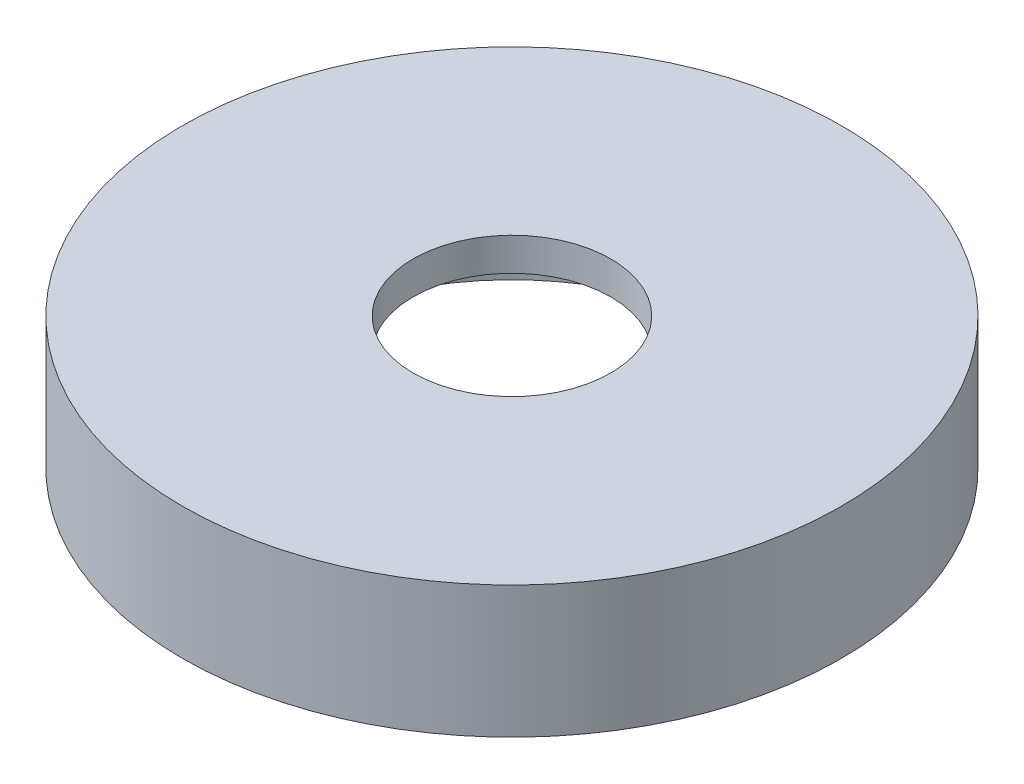
ISO-10303-21;
HEADER;
FILE_DESCRIPTION(('STEP AP214'),'2;1');
FILE_NAME('part.step','',(''),(''),'','','');
FILE_SCHEMA(('AUTOMOTIVE_DESIGN { 1 0 10303 214 1 1 1 1 }'));
ENDSEC;
DATA;
#1=APPLICATION_CONTEXT('core data for automotive mechanical design processes');
#2=APPLICATION_PROTOCOL_DEFINITION('international standard','automotive_design',2000,#1);
#3=PRODUCT_CONTEXT('',#1,'mechanical');
#4=PRODUCT('Part','Part','',(#3));
#5=PRODUCT_RELATED_PRODUCT_CATEGORY('part','',(#4));
#6=PRODUCT_DEFINITION_FORMATION('','',#4);
#7=PRODUCT_DEFINITION_CONTEXT('part definition',#1,'design');
#8=PRODUCT_DEFINITION('design','',#6,#7);
#9=PRODUCT_DEFINITION_SHAPE('','',#8);
#10=(LENGTH_UNIT() NAMED_UNIT(*) SI_UNIT(.MILLI.,.METRE.));
#11=(NAMED_UNIT(*) PLANE_ANGLE_UNIT() SI_UNIT($,.RADIAN.));
#12=(NAMED_UNIT(*) SI_UNIT($,.STERADIAN.) SOLID_ANGLE_UNIT());
#13=UNCERTAINTY_MEASURE_WITH_UNIT(LENGTH_MEASURE(1.E-05),#10,'distance_accuracy_value','');
#14=(GEOMETRIC_REPRESENTATION_CONTEXT(3) GLOBAL_UNCERTAINTY_ASSIGNED_CONTEXT((#13)) GLOBAL_UNIT_ASSIGNED_CONTEXT((#10,
#11,#12)) REPRESENTATION_CONTEXT('',''));
#15=CARTESIAN_POINT('',(0.,0.,0.));
#16=DIRECTION('',(0.,0.,1.));
#17=DIRECTION('',(1.,0.,0.));
#18=AXIS2_PLACEMENT_3D('',#15,#16,#17);
#19=CARTESIAN_POINT('',(-34.1432255553676,11.0000000000214,5.12970783045501));
#20=DIRECTION('',(0.,-1.,0.));
#21=DIRECTION('',(0.,0.,-1.));
#22=AXIS2_PLACEMENT_3D('',#19,#20,#21);
#23=CYLINDRICAL_SURFACE('',#22,20.);
#24=CARTESIAN_POINT('',(-34.1432255553676,11.0000000000214,5.12970783045501));
#25=DIRECTION('',(0.,1.,0.));
#26=DIRECTION('',(0.,0.,1.));
#27=AXIS2_PLACEMENT_3D('',#24,#25,#26);
#28=CIRCLE('',#27,20.);
#29=CARTESIAN_POINT('',(-34.1432255553676,11.0000000000214,25.129707830455));
#30=VERTEX_POINT('',#29);
#31=EDGE_CURVE('E11',#30,#30,#28,.T.);
#32=ORIENTED_EDGE('',*,*,#31,.F.);
#33=EDGE_LOOP('',(#32));
#34=FACE_BOUND('',#33,.T.);
#35=CARTESIAN_POINT('',(-34.1432255553676,3.00000000002137,5.12970783045501));
#36=DIRECTION('',(0.,1.,0.));
#37=DIRECTION('',(0.,0.,1.));
#38=AXIS2_PLACEMENT_3D('',#35,#36,#37);
#39=CIRCLE('',#38,20.);
#40=CARTESIAN_POINT('',(-34.1432255553676,3.00000000002137,25.129707830455));
#41=VERTEX_POINT('',#40);
#42=EDGE_CURVE('E37',#41,#41,#39,.T.);
#43=ORIENTED_EDGE('',*,*,#42,.T.);
#44=EDGE_LOOP('',(#43));
#45=FACE_BOUND('',#44,.T.);
#46=ADVANCED_FACE('F34',(#34,#45),#23,.T.);
#47=CARTESIAN_POINT('',(-34.1432255553676,11.0000000000214,5.12970783045501));
#48=DIRECTION('',(0.,1.,0.));
#49=DIRECTION('',(0.,0.,1.));
#50=AXIS2_PLACEMENT_3D('',#47,#48,#49);
#51=PLANE('',#50);
#52=CARTESIAN_POINT('',(-34.1432255553676,11.0000000000214,5.12970783045502));
#53=DIRECTION('',(0.,1.,0.));
#54=DIRECTION('',(0.,0.,1.));
#55=AXIS2_PLACEMENT_3D('',#52,#53,#54);
#56=CIRCLE('',#55,6.);
#57=CARTESIAN_POINT('',(-34.1432255553676,11.0000000000214,11.129707830455));
#58=VERTEX_POINT('',#57);
#59=EDGE_CURVE('E79',#58,#58,#56,.T.);
#60=ORIENTED_EDGE('',*,*,#59,.F.);
#61=EDGE_LOOP('',(#60));
#62=FACE_BOUND('',#61,.T.);
#63=ORIENTED_EDGE('',*,*,#31,.T.);
#64=EDGE_LOOP('',(#63));
#65=FACE_BOUND('',#64,.T.);
#66=ADVANCED_FACE('F96',(#62,#65),#51,.T.);
#67=CARTESIAN_POINT('',(-34.1432255553676,3.00000000002137,5.12970783045501));
#68=DIRECTION('',(0.,1.,0.));
#69=DIRECTION('',(0.,0.,1.));
#70=AXIS2_PLACEMENT_3D('',#67,#68,#69);
#71=PLANE('',#70);
#72=CARTESIAN_POINT('',(-25.6432255553676,3.00000000002137,19.8521396947905));
#73=DIRECTION('',(0.,-1.,0.));
#74=DIRECTION('',(0.,0.,-1.));
#75=AXIS2_PLACEMENT_3D('',#72,#73,#74);
#76=CIRCLE('',#75,1.24999999999999);
#77=CARTESIAN_POINT('',(-25.6432255553676,3.00000000002137,18.6021396947905));
#78=VERTEX_POINT('',#77);
#79=EDGE_CURVE('E62',#78,#78,#76,.T.);
#80=ORIENTED_EDGE('',*,*,#79,.F.);
#81=EDGE_LOOP('',(#80));
#82=FACE_BOUND('',#81,.T.);
#83=CARTESIAN_POINT('',(-51.1432255553676,3.00000000002137,5.12970783045502));
#84=DIRECTION('',(0.,-1.,0.));
#85=DIRECTION('',(0.,0.,-1.));
#86=AXIS2_PLACEMENT_3D('',#83,#84,#85);
#87=CIRCLE('',#86,1.24999999999999);
#88=CARTESIAN_POINT('',(-51.1432255553676,3.00000000002137,3.87970783045504));
#89=VERTEX_POINT('',#88);
#90=EDGE_CURVE('E61',#89,#89,#87,.T.);
#91=ORIENTED_EDGE('',*,*,#90,.F.);
#92=EDGE_LOOP('',(#91));
#93=FACE_BOUND('',#92,.T.);
#94=CARTESIAN_POINT('',(-25.6432255553676,3.00000000002137,-9.59272403388045));
#95=DIRECTION('',(0.,-1.,0.));
#96=DIRECTION('',(0.,0.,-1.));
#97=AXIS2_PLACEMENT_3D('',#94,#95,#96);
#98=CIRCLE('',#97,1.24999999999999);
#99=CARTESIAN_POINT('',(-25.6432255553676,3.00000000002137,-10.8427240338804));
#100=VERTEX_POINT('',#99);
#101=EDGE_CURVE('E72',#100,#100,#98,.T.);
#102=ORIENTED_EDGE('',*,*,#101,.F.);
#103=EDGE_LOOP('',(#102));
#104=FACE_BOUND('',#103,.T.);
#105=CARTESIAN_POINT('',(-34.1432255553676,3.00000000002137,5.12970783045501));
#106=DIRECTION('',(0.,-1.,0.));
#107=DIRECTION('',(0.,0.,-1.));
#108=AXIS2_PLACEMENT_3D('',#105,#106,#107);
#109=CIRCLE('',#108,14.);
#110=CARTESIAN_POINT('',(-34.1432255553676,3.00000000002137,-8.87029216954499));
#111=VERTEX_POINT('',#110);
#112=EDGE_CURVE('E82',#111,#111,#109,.T.);
#113=ORIENTED_EDGE('',*,*,#112,.F.);
#114=EDGE_LOOP('',(#113));
#115=FACE_BOUND('',#114,.T.);
#116=ORIENTED_EDGE('',*,*,#42,.F.);
#117=EDGE_LOOP('',(#116));
#118=FACE_BOUND('',#117,.T.);
#119=ADVANCED_FACE('F93',(#82,#93,#104,#115,#118),#71,.F.);
#120=CARTESIAN_POINT('',(-34.1432255553676,9.00000000002137,5.12970783045501));
#121=DIRECTION('',(0.,-1.,0.));
#122=DIRECTION('',(0.,0.,-1.));
#123=AXIS2_PLACEMENT_3D('',#120,#121,#122);
#124=CYLINDRICAL_SURFACE('',#123,14.);
#125=CARTESIAN_POINT('',(-34.1432255553676,9.00000000002137,5.12970783045501));
#126=DIRECTION('',(0.,-1.,0.));
#127=DIRECTION('',(0.,0.,-1.));
#128=AXIS2_PLACEMENT_3D('',#125,#126,#127);
#129=CIRCLE('',#128,14.);
#130=CARTESIAN_POINT('',(-34.1432255553676,9.00000000002137,-8.87029216954499));
#131=VERTEX_POINT('',#130);
#132=EDGE_CURVE('E85',#131,#131,#129,.T.);
#133=ORIENTED_EDGE('',*,*,#132,.F.);
#134=EDGE_LOOP('',(#133));
#135=FACE_BOUND('',#134,.T.);
#136=ORIENTED_EDGE('',*,*,#112,.T.);
#137=EDGE_LOOP('',(#136));
#138=FACE_BOUND('',#137,.T.);
#139=ADVANCED_FACE('F91',(#135,#138),#124,.F.);
#140=CARTESIAN_POINT('',(-34.1432255553676,9.00000000002137,5.12970783045501));
#141=DIRECTION('',(0.,-1.,0.));
#142=DIRECTION('',(0.,0.,-1.));
#143=AXIS2_PLACEMENT_3D('',#140,#141,#142);
#144=PLANE('',#143);
#145=CARTESIAN_POINT('',(-34.1432255553676,9.00000000002137,5.12970783045502));
#146=DIRECTION('',(0.,-1.,0.));
#147=DIRECTION('',(0.,0.,-1.));
#148=AXIS2_PLACEMENT_3D('',#145,#146,#147);
#149=CIRCLE('',#148,6.);
#150=CARTESIAN_POINT('',(-34.1432255553676,9.00000000002137,-0.870292169544973));
#151=VERTEX_POINT('',#150);
#152=EDGE_CURVE('E78',#151,#151,#149,.F.);
#153=ORIENTED_EDGE('',*,*,#152,.T.);
#154=EDGE_LOOP('',(#153));
#155=FACE_BOUND('',#154,.T.);
#156=ORIENTED_EDGE('',*,*,#132,.T.);
#157=EDGE_LOOP('',(#156));
#158=FACE_BOUND('',#157,.T.);
#159=ADVANCED_FACE('F118',(#155,#158),#144,.T.);
#160=CARTESIAN_POINT('',(-34.1432255553676,2.99900000002137,5.12970783045502));
#161=DIRECTION('',(0.,1.,0.));
#162=DIRECTION('',(0.,0.,1.));
#163=AXIS2_PLACEMENT_3D('',#160,#161,#162);
#164=CYLINDRICAL_SURFACE('',#163,6.);
#165=ORIENTED_EDGE('',*,*,#152,.F.);
#166=EDGE_LOOP('',(#165));
#167=FACE_BOUND('',#166,.T.);
#168=ORIENTED_EDGE('',*,*,#59,.T.);
#169=EDGE_LOOP('',(#168));
#170=FACE_BOUND('',#169,.T.);
#171=ADVANCED_FACE('F121',(#167,#170),#164,.F.);
#172=CARTESIAN_POINT('',(-25.6432255553676,7.00000000002137,-9.59272403388045));
#173=DIRECTION('',(0.,-1.,0.));
#174=DIRECTION('',(0.,0.,-1.));
#175=AXIS2_PLACEMENT_3D('',#172,#173,#174);
#176=CONICAL_SURFACE('',#175,1.25,1.02974425867665);
#177=CARTESIAN_POINT('',(-25.6432255553676,7.75107577380582,-9.59272403388045));
#178=VERTEX_POINT('',#177);
#179=VERTEX_LOOP('',#178);
#180=FACE_BOUND('',#179,.T.);
#181=CARTESIAN_POINT('',(-25.6432255553676,7.00000000002137,-9.59272403388045));
#182=DIRECTION('',(0.,-1.,0.));
#183=DIRECTION('',(0.,0.,-1.));
#184=AXIS2_PLACEMENT_3D('',#181,#182,#183);
#185=CIRCLE('',#184,1.25);
#186=CARTESIAN_POINT('',(-25.6432255553676,7.00000000002137,-10.8427240338804));
#187=VERTEX_POINT('',#186);
#188=EDGE_CURVE('E75',#187,#187,#185,.T.);
#189=ORIENTED_EDGE('',*,*,#188,.T.);
#190=EDGE_LOOP('',(#189));
#191=FACE_BOUND('',#190,.T.);
#192=ADVANCED_FACE('F125',(#180,#191),#176,.F.);
#193=CARTESIAN_POINT('',(-25.6432255553676,3.00000000002137,-9.59272403388045));
#194=DIRECTION('',(0.,-1.,0.));
#195=DIRECTION('',(0.,0.,-1.));
#196=AXIS2_PLACEMENT_3D('',#193,#194,#195);
#197=CYLINDRICAL_SURFACE('',#196,1.24999999999999);
#198=ORIENTED_EDGE('',*,*,#188,.F.);
#199=EDGE_LOOP('',(#198));
#200=FACE_BOUND('',#199,.T.);
#201=ORIENTED_EDGE('',*,*,#101,.T.);
#202=EDGE_LOOP('',(#201));
#203=FACE_BOUND('',#202,.T.);
#204=ADVANCED_FACE('F129',(#200,#203),#197,.F.);
#205=CARTESIAN_POINT('',(-51.1432255553676,7.00000000002137,5.12970783045502));
#206=DIRECTION('',(0.,-1.,0.));
#207=DIRECTION('',(0.,0.,-1.));
#208=AXIS2_PLACEMENT_3D('',#205,#206,#207);
#209=CONICAL_SURFACE('',#208,1.25,1.02974425867666);
#210=CARTESIAN_POINT('',(-51.1432255553676,7.75107577380582,5.12970783045502));
#211=VERTEX_POINT('',#210);
#212=VERTEX_LOOP('',#211);
#213=FACE_BOUND('',#212,.T.);
#214=CARTESIAN_POINT('',(-51.1432255553676,7.00000000002137,5.12970783045502));
#215=DIRECTION('',(0.,-1.,0.));
#216=DIRECTION('',(0.,0.,-1.));
#217=AXIS2_PLACEMENT_3D('',#214,#215,#216);
#218=CIRCLE('',#217,1.25);
#219=CARTESIAN_POINT('',(-51.1432255553676,7.00000000002137,3.87970783045502));
#220=VERTEX_POINT('',#219);
#221=EDGE_CURVE('E65',#220,#220,#218,.T.);
#222=ORIENTED_EDGE('',*,*,#221,.T.);
#223=EDGE_LOOP('',(#222));
#224=FACE_BOUND('',#223,.T.);
#225=ADVANCED_FACE('F132',(#213,#224),#209,.F.);
#226=CARTESIAN_POINT('',(-51.1432255553676,3.00000000002137,5.12970783045502));
#227=DIRECTION('',(0.,-1.,0.));
#228=DIRECTION('',(0.,0.,-1.));
#229=AXIS2_PLACEMENT_3D('',#226,#227,#228);
#230=CYLINDRICAL_SURFACE('',#229,1.24999999999999);
#231=ORIENTED_EDGE('',*,*,#221,.F.);
#232=EDGE_LOOP('',(#231));
#233=FACE_BOUND('',#232,.T.);
#234=ORIENTED_EDGE('',*,*,#90,.T.);
#235=EDGE_LOOP('',(#234));
#236=FACE_BOUND('',#235,.T.);
#237=ADVANCED_FACE('F55',(#233,#236),#230,.F.);
#238=CARTESIAN_POINT('',(-25.6432255553676,7.00000000002137,19.8521396947905));
#239=DIRECTION('',(0.,-1.,0.));
#240=DIRECTION('',(0.,0.,-1.));
#241=AXIS2_PLACEMENT_3D('',#238,#239,#240);
#242=CONICAL_SURFACE('',#241,1.25,1.02974425867665);
#243=CARTESIAN_POINT('',(-25.6432255553676,7.75107577380582,19.8521396947905));
#244=VERTEX_POINT('',#243);
#245=VERTEX_LOOP('',#244);
#246=FACE_BOUND('',#245,.T.);
#247=CARTESIAN_POINT('',(-25.6432255553676,7.00000000002137,19.8521396947905));
#248=DIRECTION('',(0.,-1.,0.));
#249=DIRECTION('',(0.,0.,-1.));
#250=AXIS2_PLACEMENT_3D('',#247,#248,#249);
#251=CIRCLE('',#250,1.25);
#252=CARTESIAN_POINT('',(-25.6432255553676,7.00000000002137,18.6021396947905));
#253=VERTEX_POINT('',#252);
#254=EDGE_CURVE('E59',#253,#253,#251,.T.);
#255=ORIENTED_EDGE('',*,*,#254,.T.);
#256=EDGE_LOOP('',(#255));
#257=FACE_BOUND('',#256,.T.);
#258=ADVANCED_FACE('F51',(#246,#257),#242,.F.);
#259=CARTESIAN_POINT('',(-25.6432255553676,3.00000000002137,19.8521396947905));
#260=DIRECTION('',(0.,-1.,0.));
#261=DIRECTION('',(0.,0.,-1.));
#262=AXIS2_PLACEMENT_3D('',#259,#260,#261);
#263=CYLINDRICAL_SURFACE('',#262,1.24999999999999);
#264=ORIENTED_EDGE('',*,*,#254,.F.);
#265=EDGE_LOOP('',(#264));
#266=FACE_BOUND('',#265,.T.);
#267=ORIENTED_EDGE('',*,*,#79,.T.);
#268=EDGE_LOOP('',(#267));
#269=FACE_BOUND('',#268,.T.);
#270=ADVANCED_FACE('F54',(#266,#269),#263,.F.);
#271=CLOSED_SHELL('',(#46,#66,#119,#139,#159,#171,#192,#204,#225,#237,#258,#270));
#272=MANIFOLD_SOLID_BREP('B2',#271);
#273=ADVANCED_BREP_SHAPE_REPRESENTATION('',(#18,#272),#14);
#274=SHAPE_DEFINITION_REPRESENTATION(#9,#273);
ENDSEC;
END-ISO-10303-21;
